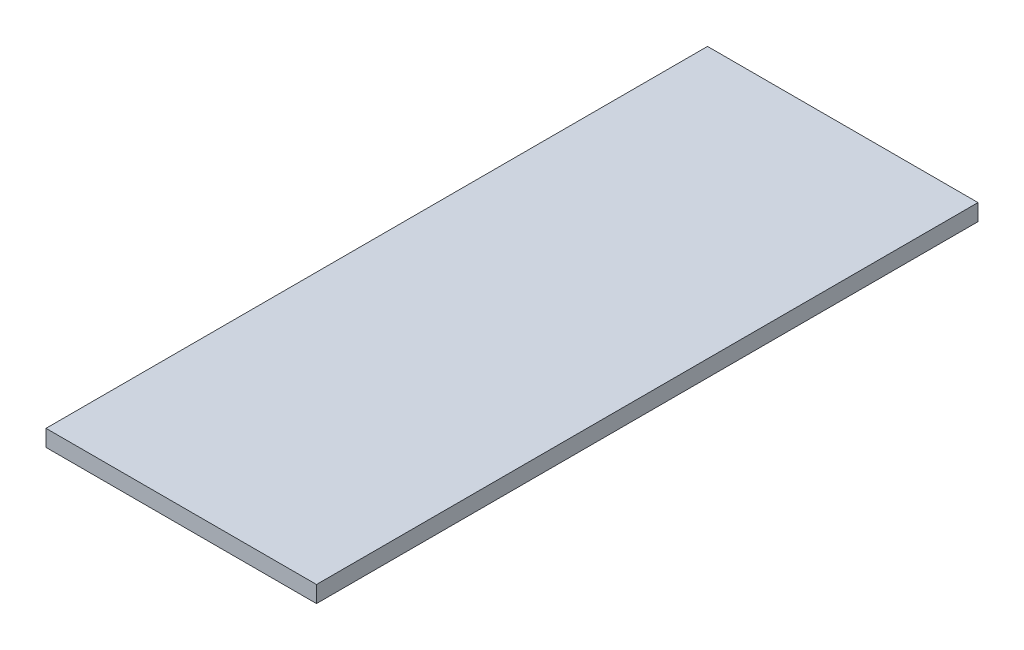
ISO-10303-21;
HEADER;
FILE_DESCRIPTION(('STEP AP214'),'2;1');
FILE_NAME('part.step','',(''),(''),'','','');
FILE_SCHEMA(('AUTOMOTIVE_DESIGN { 1 0 10303 214 1 1 1 1 }'));
ENDSEC;
DATA;
#1=APPLICATION_CONTEXT('core data for automotive mechanical design processes');
#2=APPLICATION_PROTOCOL_DEFINITION('international standard','automotive_design',2000,#1);
#3=PRODUCT_CONTEXT('',#1,'mechanical');
#4=PRODUCT('Part','Part','',(#3));
#5=PRODUCT_RELATED_PRODUCT_CATEGORY('part','',(#4));
#6=PRODUCT_DEFINITION_FORMATION('','',#4);
#7=PRODUCT_DEFINITION_CONTEXT('part definition',#1,'design');
#8=PRODUCT_DEFINITION('design','',#6,#7);
#9=PRODUCT_DEFINITION_SHAPE('','',#8);
#10=(LENGTH_UNIT() NAMED_UNIT(*) SI_UNIT(.MILLI.,.METRE.));
#11=(NAMED_UNIT(*) PLANE_ANGLE_UNIT() SI_UNIT($,.RADIAN.));
#12=(NAMED_UNIT(*) SI_UNIT($,.STERADIAN.) SOLID_ANGLE_UNIT());
#13=UNCERTAINTY_MEASURE_WITH_UNIT(LENGTH_MEASURE(1.E-05),#10,'distance_accuracy_value','');
#14=(GEOMETRIC_REPRESENTATION_CONTEXT(3) GLOBAL_UNCERTAINTY_ASSIGNED_CONTEXT((#13)) GLOBAL_UNIT_ASSIGNED_CONTEXT((#10,
#11,#12)) REPRESENTATION_CONTEXT('',''));
#15=CARTESIAN_POINT('',(0.,0.,0.));
#16=DIRECTION('',(0.,0.,1.));
#17=DIRECTION('',(1.,0.,0.));
#18=AXIS2_PLACEMENT_3D('',#15,#16,#17);
#19=CARTESIAN_POINT('',(-147.,18.,359.5));
#20=DIRECTION('',(1.,0.,0.));
#21=DIRECTION('',(0.,0.,-1.));
#22=AXIS2_PLACEMENT_3D('',#19,#20,#21);
#23=PLANE('',#22);
#24=DIRECTION('',(0.,0.,1.));
#25=VECTOR('',#24,1.);
#26=CARTESIAN_POINT('',(-147.,0.,359.5));
#27=LINE('',#26,#25);
#28=CARTESIAN_POINT('',(-147.,0.,-359.5));
#29=VERTEX_POINT('',#28);
#30=CARTESIAN_POINT('',(-147.,0.,359.5));
#31=VERTEX_POINT('',#30);
#32=EDGE_CURVE('E98',#29,#31,#27,.T.);
#33=ORIENTED_EDGE('',*,*,#32,.T.);
#34=DIRECTION('',(0.,-1.,0.));
#35=VECTOR('',#34,1.);
#36=CARTESIAN_POINT('',(-147.,18.,359.5));
#37=LINE('',#36,#35);
#38=CARTESIAN_POINT('',(-147.,18.,359.5));
#39=VERTEX_POINT('',#38);
#40=EDGE_CURVE('E11',#39,#31,#37,.T.);
#41=ORIENTED_EDGE('',*,*,#40,.F.);
#42=DIRECTION('',(0.,0.,1.));
#43=VECTOR('',#42,1.);
#44=CARTESIAN_POINT('',(-147.,18.,359.5));
#45=LINE('',#44,#43);
#46=CARTESIAN_POINT('',(-147.,18.,-359.5));
#47=VERTEX_POINT('',#46);
#48=EDGE_CURVE('E86',#47,#39,#45,.T.);
#49=ORIENTED_EDGE('',*,*,#48,.F.);
#50=DIRECTION('',(0.,-1.,0.));
#51=VECTOR('',#50,1.);
#52=CARTESIAN_POINT('',(-147.,18.,-359.5));
#53=LINE('',#52,#51);
#54=EDGE_CURVE('E94',#47,#29,#53,.T.);
#55=ORIENTED_EDGE('',*,*,#54,.T.);
#56=EDGE_LOOP('',(#33,#41,#49,#55));
#57=FACE_BOUND('',#56,.T.);
#58=ADVANCED_FACE('F35',(#57),#23,.F.);
#59=CARTESIAN_POINT('',(147.,18.,359.5));
#60=DIRECTION('',(0.,0.,-1.));
#61=DIRECTION('',(-1.,0.,0.));
#62=AXIS2_PLACEMENT_3D('',#59,#60,#61);
#63=PLANE('',#62);
#64=DIRECTION('',(1.,0.,0.));
#65=VECTOR('',#64,1.);
#66=CARTESIAN_POINT('',(147.,0.,359.5));
#67=LINE('',#66,#65);
#68=CARTESIAN_POINT('',(147.,0.,359.5));
#69=VERTEX_POINT('',#68);
#70=EDGE_CURVE('E90',#31,#69,#67,.T.);
#71=ORIENTED_EDGE('',*,*,#70,.T.);
#72=DIRECTION('',(0.,-1.,0.));
#73=VECTOR('',#72,1.);
#74=CARTESIAN_POINT('',(147.,18.,359.5));
#75=LINE('',#74,#73);
#76=CARTESIAN_POINT('',(147.,18.,359.5));
#77=VERTEX_POINT('',#76);
#78=EDGE_CURVE('E43',#77,#69,#75,.T.);
#79=ORIENTED_EDGE('',*,*,#78,.F.);
#80=DIRECTION('',(1.,0.,0.));
#81=VECTOR('',#80,1.);
#82=CARTESIAN_POINT('',(147.,18.,359.5));
#83=LINE('',#82,#81);
#84=EDGE_CURVE('E81',#39,#77,#83,.T.);
#85=ORIENTED_EDGE('',*,*,#84,.F.);
#86=ORIENTED_EDGE('',*,*,#40,.T.);
#87=EDGE_LOOP('',(#71,#79,#85,#86));
#88=FACE_BOUND('',#87,.T.);
#89=ADVANCED_FACE('F89',(#88),#63,.F.);
#90=CARTESIAN_POINT('',(147.,18.,359.5));
#91=DIRECTION('',(-1.,0.,0.));
#92=DIRECTION('',(0.,0.,1.));
#93=AXIS2_PLACEMENT_3D('',#90,#91,#92);
#94=PLANE('',#93);
#95=DIRECTION('',(0.,0.,-1.));
#96=VECTOR('',#95,1.);
#97=CARTESIAN_POINT('',(147.,0.,359.5));
#98=LINE('',#97,#96);
#99=CARTESIAN_POINT('',(147.,0.,-359.5));
#100=VERTEX_POINT('',#99);
#101=EDGE_CURVE('E68',#69,#100,#98,.T.);
#102=ORIENTED_EDGE('',*,*,#101,.T.);
#103=DIRECTION('',(0.,-1.,0.));
#104=VECTOR('',#103,1.);
#105=CARTESIAN_POINT('',(147.,18.,-359.5));
#106=LINE('',#105,#104);
#107=CARTESIAN_POINT('',(147.,18.,-359.5));
#108=VERTEX_POINT('',#107);
#109=EDGE_CURVE('E91',#108,#100,#106,.T.);
#110=ORIENTED_EDGE('',*,*,#109,.F.);
#111=DIRECTION('',(0.,0.,-1.));
#112=VECTOR('',#111,1.);
#113=CARTESIAN_POINT('',(147.,18.,359.5));
#114=LINE('',#113,#112);
#115=EDGE_CURVE('E84',#77,#108,#114,.T.);
#116=ORIENTED_EDGE('',*,*,#115,.F.);
#117=ORIENTED_EDGE('',*,*,#78,.T.);
#118=EDGE_LOOP('',(#102,#110,#116,#117));
#119=FACE_BOUND('',#118,.T.);
#120=ADVANCED_FACE('F92',(#119),#94,.F.);
#121=CARTESIAN_POINT('',(147.,18.,-359.5));
#122=DIRECTION('',(0.,0.,1.));
#123=DIRECTION('',(1.,0.,0.));
#124=AXIS2_PLACEMENT_3D('',#121,#122,#123);
#125=PLANE('',#124);
#126=DIRECTION('',(-1.,0.,0.));
#127=VECTOR('',#126,1.);
#128=CARTESIAN_POINT('',(147.,0.,-359.5));
#129=LINE('',#128,#127);
#130=EDGE_CURVE('E74',#100,#29,#129,.T.);
#131=ORIENTED_EDGE('',*,*,#130,.T.);
#132=ORIENTED_EDGE('',*,*,#54,.F.);
#133=DIRECTION('',(-1.,0.,0.));
#134=VECTOR('',#133,1.);
#135=CARTESIAN_POINT('',(147.,18.,-359.5));
#136=LINE('',#135,#134);
#137=EDGE_CURVE('E51',#108,#47,#136,.T.);
#138=ORIENTED_EDGE('',*,*,#137,.F.);
#139=ORIENTED_EDGE('',*,*,#109,.T.);
#140=EDGE_LOOP('',(#131,#132,#138,#139));
#141=FACE_BOUND('',#140,.T.);
#142=ADVANCED_FACE('F105',(#141),#125,.F.);
#143=CARTESIAN_POINT('',(0.,18.,0.));
#144=DIRECTION('',(0.,1.,0.));
#145=DIRECTION('',(0.,0.,1.));
#146=AXIS2_PLACEMENT_3D('',#143,#144,#145);
#147=PLANE('',#146);
#148=ORIENTED_EDGE('',*,*,#48,.T.);
#149=ORIENTED_EDGE('',*,*,#84,.T.);
#150=ORIENTED_EDGE('',*,*,#115,.T.);
#151=ORIENTED_EDGE('',*,*,#137,.T.);
#152=EDGE_LOOP('',(#148,#149,#150,#151));
#153=FACE_BOUND('',#152,.T.);
#154=ADVANCED_FACE('F82',(#153),#147,.T.);
#155=CARTESIAN_POINT('',(0.,0.,0.));
#156=DIRECTION('',(0.,1.,0.));
#157=DIRECTION('',(0.,0.,1.));
#158=AXIS2_PLACEMENT_3D('',#155,#156,#157);
#159=PLANE('',#158);
#160=ORIENTED_EDGE('',*,*,#32,.F.);
#161=ORIENTED_EDGE('',*,*,#130,.F.);
#162=ORIENTED_EDGE('',*,*,#101,.F.);
#163=ORIENTED_EDGE('',*,*,#70,.F.);
#164=EDGE_LOOP('',(#160,#161,#162,#163));
#165=FACE_BOUND('',#164,.T.);
#166=ADVANCED_FACE('F108',(#165),#159,.F.);
#167=CLOSED_SHELL('',(#58,#89,#120,#142,#154,#166));
#168=MANIFOLD_SOLID_BREP('B2',#167);
#169=ADVANCED_BREP_SHAPE_REPRESENTATION('',(#18,#168),#14);
#170=SHAPE_DEFINITION_REPRESENTATION(#9,#169);
ENDSEC;
END-ISO-10303-21;
